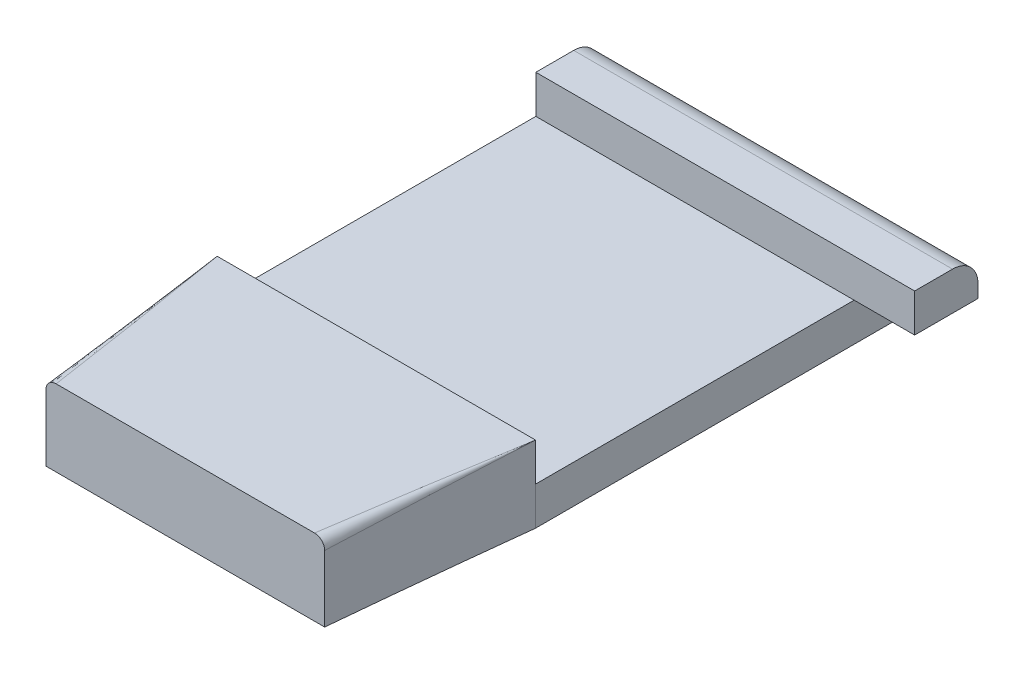
ISO-10303-21;
HEADER;
FILE_DESCRIPTION(('STEP AP214'),'2;1');
FILE_NAME('part.step','',(''),(''),'','','');
FILE_SCHEMA(('AUTOMOTIVE_DESIGN { 1 0 10303 214 1 1 1 1 }'));
ENDSEC;
DATA;
#1=APPLICATION_CONTEXT('core data for automotive mechanical design processes');
#2=APPLICATION_PROTOCOL_DEFINITION('international standard','automotive_design',2000,#1);
#3=PRODUCT_CONTEXT('',#1,'mechanical');
#4=PRODUCT('Part','Part','',(#3));
#5=PRODUCT_RELATED_PRODUCT_CATEGORY('part','',(#4));
#6=PRODUCT_DEFINITION_FORMATION('','',#4);
#7=PRODUCT_DEFINITION_CONTEXT('part definition',#1,'design');
#8=PRODUCT_DEFINITION('design','',#6,#7);
#9=PRODUCT_DEFINITION_SHAPE('','',#8);
#10=(LENGTH_UNIT() NAMED_UNIT(*) SI_UNIT(.MILLI.,.METRE.));
#11=(NAMED_UNIT(*) PLANE_ANGLE_UNIT() SI_UNIT($,.RADIAN.));
#12=(NAMED_UNIT(*) SI_UNIT($,.STERADIAN.) SOLID_ANGLE_UNIT());
#13=UNCERTAINTY_MEASURE_WITH_UNIT(LENGTH_MEASURE(1.E-05),#10,'distance_accuracy_value','');
#14=(GEOMETRIC_REPRESENTATION_CONTEXT(3) GLOBAL_UNCERTAINTY_ASSIGNED_CONTEXT((#13)) GLOBAL_UNIT_ASSIGNED_CONTEXT((#10,
#11,#12)) REPRESENTATION_CONTEXT('',''));
#15=CARTESIAN_POINT('',(0.,0.,0.));
#16=DIRECTION('',(0.,0.,1.));
#17=DIRECTION('',(1.,0.,0.));
#18=AXIS2_PLACEMENT_3D('',#15,#16,#17);
#19=CARTESIAN_POINT('',(0.,3.,0.));
#20=DIRECTION('',(0.,1.,0.));
#21=DIRECTION('',(0.,0.,1.));
#22=AXIS2_PLACEMENT_3D('',#19,#20,#21);
#23=PLANE('',#22);
#24=DIRECTION('',(0.,0.,1.));
#25=VECTOR('',#24,1.);
#26=CARTESIAN_POINT('',(106.597267150879,3.,30.));
#27=LINE('',#26,#25);
#28=CARTESIAN_POINT('',(106.597267150879,3.,4.975));
#29=VERTEX_POINT('',#28);
#30=CARTESIAN_POINT('',(106.597267150879,3.,30.));
#31=VERTEX_POINT('',#30);
#32=EDGE_CURVE('E284',#29,#31,#27,.T.);
#33=ORIENTED_EDGE('',*,*,#32,.F.);
#34=DIRECTION('',(1.,0.,0.));
#35=VECTOR('',#34,1.);
#36=CARTESIAN_POINT('',(81.5972671508789,3.,4.975));
#37=LINE('',#36,#35);
#38=CARTESIAN_POINT('',(81.5972671508789,3.,4.975));
#39=VERTEX_POINT('',#38);
#40=EDGE_CURVE('E266',#39,#29,#37,.T.);
#41=ORIENTED_EDGE('',*,*,#40,.F.);
#42=DIRECTION('',(0.,0.,-1.));
#43=VECTOR('',#42,1.);
#44=CARTESIAN_POINT('',(81.5972671508789,3.,30.));
#45=LINE('',#44,#43);
#46=CARTESIAN_POINT('',(81.5972671508789,3.,30.));
#47=VERTEX_POINT('',#46);
#48=EDGE_CURVE('E287',#47,#39,#45,.T.);
#49=ORIENTED_EDGE('',*,*,#48,.F.);
#50=DIRECTION('',(-1.,0.,0.));
#51=VECTOR('',#50,1.);
#52=CARTESIAN_POINT('',(106.597267150879,3.,30.));
#53=LINE('',#52,#51);
#54=EDGE_CURVE('E283',#31,#47,#53,.T.);
#55=ORIENTED_EDGE('',*,*,#54,.F.);
#56=EDGE_LOOP('',(#33,#41,#49,#55));
#57=FACE_BOUND('',#56,.T.);
#58=ADVANCED_FACE('F46',(#57),#23,.T.);
#59=CARTESIAN_POINT('',(0.,6.,30.));
#60=DIRECTION('',(0.,0.,-1.));
#61=DIRECTION('',(-1.,0.,0.));
#62=AXIS2_PLACEMENT_3D('',#59,#60,#61);
#63=PLANE('',#62);
#64=DIRECTION('',(0.,-1.,0.));
#65=VECTOR('',#64,1.);
#66=CARTESIAN_POINT('',(106.597267150879,6.,30.));
#67=LINE('',#66,#65);
#68=CARTESIAN_POINT('',(106.597267150879,6.,30.));
#69=VERTEX_POINT('',#68);
#70=EDGE_CURVE('E322',#69,#31,#67,.T.);
#71=ORIENTED_EDGE('',*,*,#70,.T.);
#72=ORIENTED_EDGE('',*,*,#54,.T.);
#73=DIRECTION('',(0.,-1.,0.));
#74=VECTOR('',#73,1.);
#75=CARTESIAN_POINT('',(81.5972671508789,6.,30.));
#76=LINE('',#75,#74);
#77=CARTESIAN_POINT('',(81.5972671508789,6.,30.));
#78=VERTEX_POINT('',#77);
#79=EDGE_CURVE('E312',#78,#47,#76,.T.);
#80=ORIENTED_EDGE('',*,*,#79,.F.);
#81=DIRECTION('',(1.,0.,0.));
#82=VECTOR('',#81,1.);
#83=CARTESIAN_POINT('',(0.,6.,30.));
#84=LINE('',#83,#82);
#85=EDGE_CURVE('E307',#78,#69,#84,.T.);
#86=ORIENTED_EDGE('',*,*,#85,.T.);
#87=EDGE_LOOP('',(#71,#72,#80,#86));
#88=FACE_BOUND('',#87,.T.);
#89=ADVANCED_FACE('F365',(#88),#63,.T.);
#90=CARTESIAN_POINT('',(-663.570499194392,6.,115.));
#91=DIRECTION('',(0.,-1.,0.));
#92=DIRECTION('',(0.,0.,-1.));
#93=AXIS2_PLACEMENT_3D('',#90,#91,#92);
#94=CYLINDRICAL_SURFACE('',#93,750.);
#95=CARTESIAN_POINT('',(-663.570499194392,0.,115.));
#96=DIRECTION('',(0.,1.,0.));
#97=DIRECTION('',(0.,0.,1.));
#98=AXIS2_PLACEMENT_3D('',#95,#96,#97);
#99=CIRCLE('',#98,750.);
#100=CARTESIAN_POINT('',(81.5972671508789,0.,30.));
#101=VERTEX_POINT('',#100);
#102=CARTESIAN_POINT('',(83.155688909387,0.,45.));
#103=VERTEX_POINT('',#102);
#104=EDGE_CURVE('E161',#101,#103,#99,.F.);
#105=ORIENTED_EDGE('',*,*,#104,.T.);
#106=DIRECTION('',(0.,-1.,0.));
#107=VECTOR('',#106,1.);
#108=CARTESIAN_POINT('',(83.155688909387,6.,45.));
#109=LINE('',#108,#107);
#110=CARTESIAN_POINT('',(83.1556761300614,5.21164546671452,45.0000001965936));
#111=VERTEX_POINT('',#110);
#112=EDGE_CURVE('E146',#103,#111,#109,.F.);
#113=ORIENTED_EDGE('',*,*,#112,.T.);
#114=CARTESIAN_POINT('',(81.5972671508788,6.,29.9999999999994));
#115=CARTESIAN_POINT('',(83.2062799317841,5.24999994127888,44.1056995290375));
#116=CARTESIAN_POINT('',(84.4146625646699,4.49999999996592,58.2570935038831));
#117=CARTESIAN_POINT('',(85.6233705449503,3.65625000001701,79.5185195161014));
#118=CARTESIAN_POINT('',(85.9256490779134,3.42187499998134,86.6113819054473));
#119=CARTESIAN_POINT('',(86.3287142104268,3.09375000001865,100.802829606762));
#120=CARTESIAN_POINT('',(86.429500805608,3.,107.901414764918));
#121=CARTESIAN_POINT('',(86.4295008056084,3.,122.098585235081));
#122=CARTESIAN_POINT('',(86.3287142104264,3.09375000001866,129.197170393242));
#123=CARTESIAN_POINT('',(85.9256490779138,3.42187499998135,143.388618094551));
#124=CARTESIAN_POINT('',(85.6233705449534,3.65625000001705,150.481480483837));
#125=CARTESIAN_POINT('',(84.4146625646635,4.49999999996596,171.742906496244));
#126=CARTESIAN_POINT('',(83.2062799317906,5.24999994055407,185.894300470906));
#127=CARTESIAN_POINT('',(81.5972671508789,6.,200.));
#128=(BOUNDED_CURVE() B_SPLINE_CURVE(3,(#114,#115,#116,#117,#118,#119,#120,#121,#122,#123,#124,
#125,#126,#127),.UNSPECIFIED.,.F.,.F.) B_SPLINE_CURVE_WITH_KNOTS((4,2,2,2,2,2,4),
(1.45721896303359,1.51400764491425,1.54240198585457,1.5707963267949,1.59919066773522,
1.62758500867555,1.6843736905562),
.UNSPECIFIED.) CURVE() GEOMETRIC_REPRESENTATION_ITEM() RATIONAL_B_SPLINE_CURVE((1.,1.,1.,1.,1.,
1.,1.,1.,1.,1.,1.,1.,1.,1.)) REPRESENTATION_ITEM(''));
#129=EDGE_CURVE('E156',#111,#78,#128,.F.);
#130=ORIENTED_EDGE('',*,*,#129,.T.);
#131=ORIENTED_EDGE('',*,*,#79,.T.);
#132=DIRECTION('',(0.,-1.,0.));
#133=VECTOR('',#132,1.);
#134=CARTESIAN_POINT('',(81.5972671508789,3.,30.));
#135=LINE('',#134,#133);
#136=EDGE_CURVE('E300',#47,#101,#135,.T.);
#137=ORIENTED_EDGE('',*,*,#136,.T.);
#138=EDGE_LOOP('',(#105,#113,#130,#131,#137));
#139=FACE_BOUND('',#138,.T.);
#140=ADVANCED_FACE('F154',(#139),#94,.F.);
#141=CARTESIAN_POINT('',(851.76503349615,6.,115.));
#142=DIRECTION('',(0.,-1.,0.));
#143=DIRECTION('',(0.,0.,-1.));
#144=AXIS2_PLACEMENT_3D('',#141,#142,#143);
#145=CYLINDRICAL_SURFACE('',#144,750.);
#146=CARTESIAN_POINT('',(106.597267150879,6.,199.999999999997));
#147=CARTESIAN_POINT('',(104.98825436999,5.24999993713063,185.894300471102));
#148=CARTESIAN_POINT('',(103.779871737092,4.49999999996471,171.742906496225));
#149=CARTESIAN_POINT('',(102.571163756806,3.65625000001776,150.481480483848));
#150=CARTESIAN_POINT('',(102.268885223843,3.42187499998477,143.388618094539));
#151=CARTESIAN_POINT('',(101.865820091332,3.09375000001516,129.19717039325));
#152=CARTESIAN_POINT('',(101.765033496149,3.00000000000154,122.09858523508));
#153=CARTESIAN_POINT('',(101.76503349615,2.99999999999846,107.901414764917));
#154=CARTESIAN_POINT('',(101.86582009133,3.09375000001831,100.80282960676));
#155=CARTESIAN_POINT('',(102.268885223845,3.42187499998177,86.6113819054441));
#156=CARTESIAN_POINT('',(102.571163756806,3.65625000001452,79.518519516112));
#157=CARTESIAN_POINT('',(103.77987173709,4.4999999999707,58.2570935038658));
#158=CARTESIAN_POINT('',(104.988254369975,5.24999994073761,44.1056995290216));
#159=CARTESIAN_POINT('',(106.597267150879,6.,29.9999999999994));
#160=(BOUNDED_CURVE() B_SPLINE_CURVE(3,(#146,#147,#148,#149,#150,#151,#152,#153,#154,#155,#156,
#157,#158,#159),.UNSPECIFIED.,.F.,.F.) B_SPLINE_CURVE_WITH_KNOTS((4,2,2,2,2,2,4),
(4.59881161662339,4.65560029850404,4.68399463944436,4.71238898038469,4.74078332132502,
4.76917766226534,4.82596634414599),
.UNSPECIFIED.) CURVE() GEOMETRIC_REPRESENTATION_ITEM() RATIONAL_B_SPLINE_CURVE((1.,1.,1.,1.,1.,
1.,1.,1.,1.,1.,1.,1.,1.,1.)) REPRESENTATION_ITEM(''));
#161=CARTESIAN_POINT('',(105.038853887454,5.21165708840962,45.0000003921199));
#162=VERTEX_POINT('',#161);
#163=EDGE_CURVE('E428',#69,#162,#160,.F.);
#164=ORIENTED_EDGE('',*,*,#163,.T.);
#165=DIRECTION('',(0.,-1.,0.));
#166=VECTOR('',#165,1.);
#167=CARTESIAN_POINT('',(105.038845392371,6.,45.));
#168=LINE('',#167,#166);
#169=CARTESIAN_POINT('',(105.038845392371,0.,45.));
#170=VERTEX_POINT('',#169);
#171=EDGE_CURVE('E251',#162,#170,#168,.T.);
#172=ORIENTED_EDGE('',*,*,#171,.T.);
#173=CARTESIAN_POINT('',(851.76503349615,0.,115.));
#174=DIRECTION('',(0.,1.,0.));
#175=DIRECTION('',(0.,0.,1.));
#176=AXIS2_PLACEMENT_3D('',#173,#174,#175);
#177=CIRCLE('',#176,750.);
#178=CARTESIAN_POINT('',(106.597267150879,0.,30.));
#179=VERTEX_POINT('',#178);
#180=EDGE_CURVE('E305',#170,#179,#177,.F.);
#181=ORIENTED_EDGE('',*,*,#180,.T.);
#182=DIRECTION('',(0.,-1.,0.));
#183=VECTOR('',#182,1.);
#184=CARTESIAN_POINT('',(106.597267150879,3.,30.));
#185=LINE('',#184,#183);
#186=EDGE_CURVE('E290',#31,#179,#185,.T.);
#187=ORIENTED_EDGE('',*,*,#186,.F.);
#188=ORIENTED_EDGE('',*,*,#70,.F.);
#189=EDGE_LOOP('',(#164,#172,#181,#187,#188));
#190=FACE_BOUND('',#189,.T.);
#191=ADVANCED_FACE('F335',(#190),#145,.F.);
#192=CARTESIAN_POINT('',(0.,6.,0.));
#193=DIRECTION('',(0.,1.,0.));
#194=DIRECTION('',(0.,0.,1.));
#195=AXIS2_PLACEMENT_3D('',#192,#193,#194);
#196=PLANE('',#195);
#197=DIRECTION('',(-1.,0.,0.));
#198=VECTOR('',#197,1.);
#199=CARTESIAN_POINT('',(0.,6.,45.));
#200=LINE('',#199,#198);
#201=CARTESIAN_POINT('',(104.243337477084,6.,45.0000000007444));
#202=VERTEX_POINT('',#201);
#203=CARTESIAN_POINT('',(83.9512141345285,6.,44.9999999998057));
#204=VERTEX_POINT('',#203);
#205=EDGE_CURVE('E62',#202,#204,#200,.T.);
#206=ORIENTED_EDGE('',*,*,#205,.F.);
#207=CARTESIAN_POINT('',(106.597267150879,6.,29.9999999999994));
#208=CARTESIAN_POINT('',(104.243306710969,6.,44.0193882796078));
#209=CARTESIAN_POINT('',(102.284505766993,6.,58.1329769778131));
#210=CARTESIAN_POINT('',(100.230084002653,6.,79.4049822113751));
#211=CARTESIAN_POINT('',(99.6925362995021,6.,86.5122438411736));
#212=CARTESIAN_POINT('',(98.9600047245418,6.,100.746263381872));
#213=CARTESIAN_POINT('',(98.7650334961006,6.,107.873020423946));
#214=CARTESIAN_POINT('',(98.7650334961991,6.,122.12697957605));
#215=CARTESIAN_POINT('',(98.9600047249849,6.,129.253736618124));
#216=CARTESIAN_POINT('',(99.6925362990585,6.,143.487756158823));
#217=CARTESIAN_POINT('',(100.230084002752,6.,150.595017788628));
#218=CARTESIAN_POINT('',(102.284505766796,6.,171.86702302219));
#219=CARTESIAN_POINT('',(104.243306710582,6.,185.98061172048));
#220=CARTESIAN_POINT('',(106.597267150879,6.,199.999999999997));
#221=(BOUNDED_CURVE() B_SPLINE_CURVE(3,(#207,#208,#209,#210,#211,#212,#213,#214,#215,#216,#217,
#218,#219,#220),.UNSPECIFIED.,.F.,.F.) B_SPLINE_CURVE_WITH_KNOTS((4,2,2,2,2,2,4),
(4.59881161662339,4.65560029850404,4.68399463944436,4.71238898038469,4.74078332132502,
4.76917766226534,4.82596634414599),
.UNSPECIFIED.) CURVE() GEOMETRIC_REPRESENTATION_ITEM() RATIONAL_B_SPLINE_CURVE((0.999999999999973,
0.999999999999973,0.999999999999973,0.999999999999973,0.999999999999973,0.999999999999973,
0.999999999999973,0.999999999999973,0.999999999999973,0.999999999999973,0.999999999999973,
0.999999999999973,0.999999999999973,0.999999999999973)) REPRESENTATION_ITEM(''));
#222=EDGE_CURVE('E317',#202,#69,#221,.F.);
#223=ORIENTED_EDGE('',*,*,#222,.T.);
#224=ORIENTED_EDGE('',*,*,#85,.F.);
#225=CARTESIAN_POINT('',(81.5972671508789,6.,200.));
#226=CARTESIAN_POINT('',(83.9512275914429,6.,185.980611720473));
#227=CARTESIAN_POINT('',(85.9100285345366,6.,171.867023022186));
#228=CARTESIAN_POINT('',(87.9644502992186,6.,150.595017788629));
#229=CARTESIAN_POINT('',(88.5019980023426,6.,143.487756158828));
#230=CARTESIAN_POINT('',(89.2345295771292,6.,129.253736618123));
#231=CARTESIAN_POINT('',(89.429500805608,6.,122.126979576007));
#232=CARTESIAN_POINT('',(89.429500805608,6.,107.873020423992));
#233=CARTESIAN_POINT('',(89.2345295771785,6.,100.746263381828));
#234=CARTESIAN_POINT('',(88.5019980022934,6.,86.5122438412223));
#235=CARTESIAN_POINT('',(87.9644502989724,6.,79.4049822114219));
#236=CARTESIAN_POINT('',(85.9100285350292,6.,58.1329769777163));
#237=CARTESIAN_POINT('',(83.9512275903507,6.,44.0193882797219));
#238=CARTESIAN_POINT('',(81.5972671508788,6.,29.9999999999994));
#239=(BOUNDED_CURVE() B_SPLINE_CURVE(3,(#225,#226,#227,#228,#229,#230,#231,#232,#233,#234,#235,
#236,#237,#238),.UNSPECIFIED.,.F.,.F.) B_SPLINE_CURVE_WITH_KNOTS((4,2,2,2,2,2,4),
(1.45721896303359,1.51400764491425,1.54240198585457,1.5707963267949,1.59919066773522,
1.62758500867555,1.6843736905562),
.UNSPECIFIED.) CURVE() GEOMETRIC_REPRESENTATION_ITEM() RATIONAL_B_SPLINE_CURVE((0.99999999999997,
0.99999999999997,0.99999999999997,0.99999999999997,0.99999999999997,0.99999999999997,
0.99999999999997,0.99999999999997,0.99999999999997,0.99999999999997,0.99999999999997,
0.99999999999997,0.99999999999997,0.99999999999997)) REPRESENTATION_ITEM(''));
#240=EDGE_CURVE('E166',#78,#204,#239,.F.);
#241=ORIENTED_EDGE('',*,*,#240,.T.);
#242=EDGE_LOOP('',(#206,#223,#224,#241));
#243=FACE_BOUND('',#242,.T.);
#244=ADVANCED_FACE('F324',(#243),#196,.T.);
#245=CARTESIAN_POINT('',(0.,0.,0.));
#246=DIRECTION('',(0.,1.,0.));
#247=DIRECTION('',(0.,0.,1.));
#248=AXIS2_PLACEMENT_3D('',#245,#246,#247);
#249=PLANE('',#248);
#250=ORIENTED_EDGE('',*,*,#180,.F.);
#251=DIRECTION('',(-1.,0.,0.));
#252=VECTOR('',#251,1.);
#253=CARTESIAN_POINT('',(0.,0.,45.));
#254=LINE('',#253,#252);
#255=EDGE_CURVE('E249',#170,#103,#254,.T.);
#256=ORIENTED_EDGE('',*,*,#255,.T.);
#257=ORIENTED_EDGE('',*,*,#104,.F.);
#258=DIRECTION('',(0.,0.,-1.));
#259=VECTOR('',#258,1.);
#260=CARTESIAN_POINT('',(81.5972671508789,0.,30.));
#261=LINE('',#260,#259);
#262=CARTESIAN_POINT('',(81.5972671508789,0.,0.5));
#263=VERTEX_POINT('',#262);
#264=EDGE_CURVE('E293',#101,#263,#261,.T.);
#265=ORIENTED_EDGE('',*,*,#264,.T.);
#266=DIRECTION('',(1.,0.,0.));
#267=VECTOR('',#266,1.);
#268=CARTESIAN_POINT('',(106.597267150879,0.,0.5));
#269=LINE('',#268,#267);
#270=CARTESIAN_POINT('',(106.597267150879,0.,0.5));
#271=VERTEX_POINT('',#270);
#272=EDGE_CURVE('E168',#263,#271,#269,.T.);
#273=ORIENTED_EDGE('',*,*,#272,.T.);
#274=DIRECTION('',(0.,0.,1.));
#275=VECTOR('',#274,1.);
#276=CARTESIAN_POINT('',(106.597267150879,0.,30.));
#277=LINE('',#276,#275);
#278=EDGE_CURVE('E279',#271,#179,#277,.T.);
#279=ORIENTED_EDGE('',*,*,#278,.T.);
#280=EDGE_LOOP('',(#250,#256,#257,#265,#273,#279));
#281=FACE_BOUND('',#280,.T.);
#282=ADVANCED_FACE('F334',(#281),#249,.F.);
#283=CARTESIAN_POINT('',(106.597267150879,3.,30.));
#284=DIRECTION('',(1.,0.,0.));
#285=DIRECTION('',(0.,0.,-1.));
#286=AXIS2_PLACEMENT_3D('',#283,#284,#285);
#287=PLANE('',#286);
#288=ORIENTED_EDGE('',*,*,#278,.F.);
#289=CARTESIAN_POINT('',(106.597267150879,0.5,0.5));
#290=DIRECTION('',(1.,0.,0.));
#291=DIRECTION('',(0.,0.,-1.));
#292=AXIS2_PLACEMENT_3D('',#289,#290,#291);
#293=CIRCLE('',#292,0.5);
#294=CARTESIAN_POINT('',(106.597267150879,0.5,0.));
#295=VERTEX_POINT('',#294);
#296=EDGE_CURVE('E406',#271,#295,#293,.T.);
#297=ORIENTED_EDGE('',*,*,#296,.T.);
#298=DIRECTION('',(0.,-1.,0.));
#299=VECTOR('',#298,1.);
#300=CARTESIAN_POINT('',(106.597267150879,3.,0.));
#301=LINE('',#300,#299);
#302=CARTESIAN_POINT('',(106.597267150879,3.,0.));
#303=VERTEX_POINT('',#302);
#304=EDGE_CURVE('E296',#303,#295,#301,.T.);
#305=ORIENTED_EDGE('',*,*,#304,.F.);
#306=EDGE_CURVE('E280',#303,#29,#27,.T.);
#307=ORIENTED_EDGE('',*,*,#306,.T.);
#308=ORIENTED_EDGE('',*,*,#32,.T.);
#309=ORIENTED_EDGE('',*,*,#186,.T.);
#310=EDGE_LOOP('',(#288,#297,#305,#307,#308,#309));
#311=FACE_BOUND('',#310,.T.);
#312=ADVANCED_FACE('F337',(#311),#287,.T.);
#313=CARTESIAN_POINT('',(106.597267150879,3.,0.));
#314=DIRECTION('',(0.,0.,-1.));
#315=DIRECTION('',(-1.,0.,0.));
#316=AXIS2_PLACEMENT_3D('',#313,#314,#315);
#317=PLANE('',#316);
#318=ORIENTED_EDGE('',*,*,#304,.T.);
#319=DIRECTION('',(1.,0.,0.));
#320=VECTOR('',#319,1.);
#321=CARTESIAN_POINT('',(81.5972671508789,0.5,0.));
#322=LINE('',#321,#320);
#323=CARTESIAN_POINT('',(81.5972671508789,0.5,0.));
#324=VERTEX_POINT('',#323);
#325=EDGE_CURVE('E70',#295,#324,#322,.F.);
#326=ORIENTED_EDGE('',*,*,#325,.T.);
#327=DIRECTION('',(0.,-1.,0.));
#328=VECTOR('',#327,1.);
#329=CARTESIAN_POINT('',(81.5972671508789,3.,0.));
#330=LINE('',#329,#328);
#331=CARTESIAN_POINT('',(81.5972671508789,4.,0.));
#332=VERTEX_POINT('',#331);
#333=EDGE_CURVE('E298',#332,#324,#330,.T.);
#334=ORIENTED_EDGE('',*,*,#333,.F.);
#335=DIRECTION('',(-1.,0.,0.));
#336=VECTOR('',#335,1.);
#337=CARTESIAN_POINT('',(106.597267150879,4.,0.));
#338=LINE('',#337,#336);
#339=CARTESIAN_POINT('',(111.347267150879,4.,0.));
#340=VERTEX_POINT('',#339);
#341=EDGE_CURVE('E314',#332,#340,#338,.F.);
#342=ORIENTED_EDGE('',*,*,#341,.T.);
#343=DIRECTION('',(0.,-1.,0.));
#344=VECTOR('',#343,1.);
#345=CARTESIAN_POINT('',(111.347267150879,6.,0.));
#346=LINE('',#345,#344);
#347=CARTESIAN_POINT('',(111.347267150879,3.,0.));
#348=VERTEX_POINT('',#347);
#349=EDGE_CURVE('E265',#340,#348,#346,.T.);
#350=ORIENTED_EDGE('',*,*,#349,.T.);
#351=DIRECTION('',(-1.,0.,0.));
#352=VECTOR('',#351,1.);
#353=CARTESIAN_POINT('',(81.5972671508789,3.,0.));
#354=LINE('',#353,#352);
#355=EDGE_CURVE('E260',#348,#303,#354,.T.);
#356=ORIENTED_EDGE('',*,*,#355,.T.);
#357=EDGE_LOOP('',(#318,#326,#334,#342,#350,#356));
#358=FACE_BOUND('',#357,.T.);
#359=ADVANCED_FACE('F390',(#358),#317,.T.);
#360=CARTESIAN_POINT('',(81.5972671508789,3.,30.));
#361=DIRECTION('',(-1.,0.,0.));
#362=DIRECTION('',(0.,0.,1.));
#363=AXIS2_PLACEMENT_3D('',#360,#361,#362);
#364=PLANE('',#363);
#365=ORIENTED_EDGE('',*,*,#333,.T.);
#366=CARTESIAN_POINT('',(81.5972671508789,0.5,0.5));
#367=DIRECTION('',(-1.,0.,0.));
#368=DIRECTION('',(0.,0.,1.));
#369=AXIS2_PLACEMENT_3D('',#366,#367,#368);
#370=CIRCLE('',#369,0.5);
#371=EDGE_CURVE('E55',#324,#263,#370,.T.);
#372=ORIENTED_EDGE('',*,*,#371,.T.);
#373=ORIENTED_EDGE('',*,*,#264,.F.);
#374=ORIENTED_EDGE('',*,*,#136,.F.);
#375=ORIENTED_EDGE('',*,*,#48,.T.);
#376=DIRECTION('',(0.,-1.,0.));
#377=VECTOR('',#376,1.);
#378=CARTESIAN_POINT('',(81.5972671508789,6.,4.975));
#379=LINE('',#378,#377);
#380=CARTESIAN_POINT('',(81.5972671508789,6.,4.975));
#381=VERTEX_POINT('',#380);
#382=EDGE_CURVE('E277',#381,#39,#379,.T.);
#383=ORIENTED_EDGE('',*,*,#382,.F.);
#384=DIRECTION('',(0.,0.,1.));
#385=VECTOR('',#384,1.);
#386=CARTESIAN_POINT('',(81.5972671508789,6.,0.));
#387=LINE('',#386,#385);
#388=CARTESIAN_POINT('',(81.5972671508789,6.,2.));
#389=VERTEX_POINT('',#388);
#390=EDGE_CURVE('E257',#389,#381,#387,.T.);
#391=ORIENTED_EDGE('',*,*,#390,.F.);
#392=CARTESIAN_POINT('',(81.5972671508789,4.,2.));
#393=DIRECTION('',(-1.,0.,0.));
#394=DIRECTION('',(0.,0.,1.));
#395=AXIS2_PLACEMENT_3D('',#392,#393,#394);
#396=CIRCLE('',#395,2.);
#397=EDGE_CURVE('E311',#389,#332,#396,.T.);
#398=ORIENTED_EDGE('',*,*,#397,.T.);
#399=EDGE_LOOP('',(#365,#372,#373,#374,#375,#383,#391,#398));
#400=FACE_BOUND('',#399,.T.);
#401=ADVANCED_FACE('F392',(#400),#364,.T.);
#402=CARTESIAN_POINT('',(81.5972671508789,6.,4.975));
#403=DIRECTION('',(0.,0.,-1.));
#404=DIRECTION('',(-1.,0.,0.));
#405=AXIS2_PLACEMENT_3D('',#402,#403,#404);
#406=PLANE('',#405);
#407=ORIENTED_EDGE('',*,*,#40,.T.);
#408=CARTESIAN_POINT('',(111.347267150879,3.,4.975));
#409=VERTEX_POINT('',#408);
#410=EDGE_CURVE('E254',#29,#409,#37,.T.);
#411=ORIENTED_EDGE('',*,*,#410,.T.);
#412=DIRECTION('',(0.,-1.,0.));
#413=VECTOR('',#412,1.);
#414=CARTESIAN_POINT('',(111.347267150879,6.,4.975));
#415=LINE('',#414,#413);
#416=CARTESIAN_POINT('',(111.347267150879,6.,4.975));
#417=VERTEX_POINT('',#416);
#418=EDGE_CURVE('E274',#417,#409,#415,.T.);
#419=ORIENTED_EDGE('',*,*,#418,.F.);
#420=DIRECTION('',(1.,0.,0.));
#421=VECTOR('',#420,1.);
#422=CARTESIAN_POINT('',(81.5972671508789,6.,4.975));
#423=LINE('',#422,#421);
#424=EDGE_CURVE('E259',#381,#417,#423,.T.);
#425=ORIENTED_EDGE('',*,*,#424,.F.);
#426=ORIENTED_EDGE('',*,*,#382,.T.);
#427=EDGE_LOOP('',(#407,#411,#419,#425,#426));
#428=FACE_BOUND('',#427,.T.);
#429=ADVANCED_FACE('F388',(#428),#406,.F.);
#430=CARTESIAN_POINT('',(111.347267150879,6.,0.));
#431=DIRECTION('',(-1.,0.,0.));
#432=DIRECTION('',(0.,0.,1.));
#433=AXIS2_PLACEMENT_3D('',#430,#431,#432);
#434=PLANE('',#433);
#435=ORIENTED_EDGE('',*,*,#349,.F.);
#436=CARTESIAN_POINT('',(111.347267150879,4.,2.));
#437=DIRECTION('',(-1.,0.,0.));
#438=DIRECTION('',(0.,0.,1.));
#439=AXIS2_PLACEMENT_3D('',#436,#437,#438);
#440=CIRCLE('',#439,2.);
#441=CARTESIAN_POINT('',(111.347267150879,6.,2.));
#442=VERTEX_POINT('',#441);
#443=EDGE_CURVE('E316',#340,#442,#440,.F.);
#444=ORIENTED_EDGE('',*,*,#443,.T.);
#445=DIRECTION('',(0.,0.,-1.));
#446=VECTOR('',#445,1.);
#447=CARTESIAN_POINT('',(111.347267150879,6.,0.));
#448=LINE('',#447,#446);
#449=EDGE_CURVE('E262',#417,#442,#448,.T.);
#450=ORIENTED_EDGE('',*,*,#449,.F.);
#451=ORIENTED_EDGE('',*,*,#418,.T.);
#452=DIRECTION('',(0.,0.,-1.));
#453=VECTOR('',#452,1.);
#454=CARTESIAN_POINT('',(111.347267150879,3.,0.));
#455=LINE('',#454,#453);
#456=EDGE_CURVE('E269',#409,#348,#455,.T.);
#457=ORIENTED_EDGE('',*,*,#456,.T.);
#458=EDGE_LOOP('',(#435,#444,#450,#451,#457));
#459=FACE_BOUND('',#458,.T.);
#460=ADVANCED_FACE('F398',(#459),#434,.F.);
#461=CARTESIAN_POINT('',(0.,6.,0.));
#462=DIRECTION('',(0.,1.,0.));
#463=DIRECTION('',(0.,0.,1.));
#464=AXIS2_PLACEMENT_3D('',#461,#462,#463);
#465=PLANE('',#464);
#466=ORIENTED_EDGE('',*,*,#449,.T.);
#467=DIRECTION('',(-1.,0.,0.));
#468=VECTOR('',#467,1.);
#469=CARTESIAN_POINT('',(0.,6.,2.));
#470=LINE('',#469,#468);
#471=EDGE_CURVE('E308',#442,#389,#470,.T.);
#472=ORIENTED_EDGE('',*,*,#471,.T.);
#473=ORIENTED_EDGE('',*,*,#390,.T.);
#474=ORIENTED_EDGE('',*,*,#424,.T.);
#475=EDGE_LOOP('',(#466,#472,#473,#474));
#476=FACE_BOUND('',#475,.T.);
#477=ADVANCED_FACE('F237',(#476),#465,.T.);
#478=CARTESIAN_POINT('',(0.,3.,0.));
#479=DIRECTION('',(0.,1.,0.));
#480=DIRECTION('',(0.,0.,1.));
#481=AXIS2_PLACEMENT_3D('',#478,#479,#480);
#482=PLANE('',#481);
#483=ORIENTED_EDGE('',*,*,#306,.F.);
#484=ORIENTED_EDGE('',*,*,#355,.F.);
#485=ORIENTED_EDGE('',*,*,#456,.F.);
#486=ORIENTED_EDGE('',*,*,#410,.F.);
#487=EDGE_LOOP('',(#483,#484,#485,#486));
#488=FACE_BOUND('',#487,.T.);
#489=ADVANCED_FACE('F371',(#488),#482,.F.);
#490=CARTESIAN_POINT('',(0.,4.,2.));
#491=DIRECTION('',(-1.,0.,0.));
#492=DIRECTION('',(0.,0.,1.));
#493=AXIS2_PLACEMENT_3D('',#490,#491,#492);
#494=CYLINDRICAL_SURFACE('',#493,2.);
#495=ORIENTED_EDGE('',*,*,#443,.F.);
#496=ORIENTED_EDGE('',*,*,#341,.F.);
#497=ORIENTED_EDGE('',*,*,#397,.F.);
#498=ORIENTED_EDGE('',*,*,#471,.F.);
#499=EDGE_LOOP('',(#495,#496,#497,#498));
#500=FACE_BOUND('',#499,.T.);
#501=ADVANCED_FACE('F369',(#500),#494,.T.);
#502=CARTESIAN_POINT('',(106.597267150879,6.,29.9999999999994));
#503=CARTESIAN_POINT('',(104.988254369975,5.24999994073761,44.1056995290216));
#504=CARTESIAN_POINT('',(103.77987173709,4.4999999999707,58.2570935038658));
#505=CARTESIAN_POINT('',(102.571163756806,3.65625000001452,79.518519516112));
#506=CARTESIAN_POINT('',(102.268885223845,3.42187499998177,86.6113819054441));
#507=CARTESIAN_POINT('',(101.86582009133,3.09375000001831,100.80282960676));
#508=CARTESIAN_POINT('',(101.76503349615,2.99999999999846,107.901414764917));
#509=CARTESIAN_POINT('',(101.765033496149,3.00000000000154,122.09858523508));
#510=CARTESIAN_POINT('',(101.865820091332,3.09375000001516,129.19717039325));
#511=CARTESIAN_POINT('',(102.268885223843,3.42187499998477,143.388618094539));
#512=CARTESIAN_POINT('',(102.571163756806,3.65625000001776,150.481480483848));
#513=CARTESIAN_POINT('',(103.779871737092,4.49999999996471,171.742906496225));
#514=CARTESIAN_POINT('',(104.98825436999,5.24999993713063,185.894300471102));
#515=CARTESIAN_POINT('',(106.597267150879,6.,199.999999999997));
#516=CARTESIAN_POINT('',(106.597267150879,6.,29.9999999999994));
#517=CARTESIAN_POINT('',(104.988254368572,5.99999999990764,44.1056995319905));
#518=CARTESIAN_POINT('',(103.779871736552,6.00000000009851,58.2570935038352));
#519=CARTESIAN_POINT('',(102.571163757075,5.99999999995074,79.5185195161273));
#520=CARTESIAN_POINT('',(102.26888522397,6.,86.6113819054477));
#521=CARTESIAN_POINT('',(101.865820091205,6.,100.802829606757));
#522=CARTESIAN_POINT('',(101.7650334961,6.,107.901414764868));
#523=CARTESIAN_POINT('',(101.765033496199,6.,122.098585235129));
#524=CARTESIAN_POINT('',(101.865820091697,5.99999999995074,129.19717039324));
#525=CARTESIAN_POINT('',(102.268885223478,6.00000000004926,143.388618094549));
#526=CARTESIAN_POINT('',(102.571163757174,6.00000000004926,150.481480483827));
#527=CARTESIAN_POINT('',(103.779871736356,5.99999999990149,171.742906496267));
#528=CARTESIAN_POINT('',(104.988254371274,6.00000000009851,185.894300467643));
#529=CARTESIAN_POINT('',(106.597267150879,6.,199.999999999997));
#530=CARTESIAN_POINT('',(106.597267150879,6.,29.9999999999994));
#531=CARTESIAN_POINT('',(104.243306710969,6.,44.0193882796078));
#532=CARTESIAN_POINT('',(102.284505766993,6.,58.1329769778131));
#533=CARTESIAN_POINT('',(100.230084002653,6.,79.4049822113751));
#534=CARTESIAN_POINT('',(99.6925362995019,6.,86.5122438411736));
#535=CARTESIAN_POINT('',(98.9600047245416,6.,100.746263381872));
#536=CARTESIAN_POINT('',(98.7650334961004,6.,107.873020423946));
#537=CARTESIAN_POINT('',(98.7650334961989,6.,122.12697957605));
#538=CARTESIAN_POINT('',(98.9600047249847,6.,129.253736618124));
#539=CARTESIAN_POINT('',(99.6925362990583,6.,143.487756158823));
#540=CARTESIAN_POINT('',(100.230084002752,6.,150.595017788628));
#541=CARTESIAN_POINT('',(102.284505766796,6.,171.86702302219));
#542=CARTESIAN_POINT('',(104.243306710582,6.,185.98061172048));
#543=CARTESIAN_POINT('',(106.597267150879,6.,199.999999999997));
#544=(BOUNDED_SURFACE() B_SPLINE_SURFACE(2,3,((#502,#503,#504,#505,#506,#507,#508,#509,#510,
#511,#512,#513,#514,#515),(#516,#517,#518,#519,#520,#521,#522,#523,#524,#525,#526,#527,#528,
#529),(#530,#531,#532,#533,#534,#535,#536,#537,#538,#539,#540,#541,#542,#543)),.UNSPECIFIED.,
.F.,.F.,.F.) B_SPLINE_SURFACE_WITH_KNOTS((3,3),(4,2,2,2,2,2,4),(0.,1.),(4.59881161662339,
4.65560029850404,4.68399463944436,4.71238898038469,4.74078332132502,4.76917766226534,
4.82596634414599),.UNSPECIFIED.) GEOMETRIC_REPRESENTATION_ITEM() RATIONAL_B_SPLINE_SURFACE(((1.,
1.,1.,1.,1.,1.,1.,1.,1.,1.,1.,1.,1.,1.),(0.707106781186548,0.70710678118655,0.707106781186548,
0.707106781186548,0.707106781186547,0.707106781186547,0.707106781186547,0.707106781186547,
0.707106781186547,0.707106781186547,0.707106781186548,0.707106781186548,0.707106781186547,
0.707106781186548),(1.,1.,1.,1.,1.,1.,1.,1.,1.,1.,1.,1.,1.,1.))) REPRESENTATION_ITEM('') SURFACE());
#545=CARTESIAN_POINT('',(105.038862455739,5.21163382353432,45.0000000016276));
#546=CARTESIAN_POINT('',(105.038902311491,5.255745686639,45.0000000005845));
#547=CARTESIAN_POINT('',(105.035146571757,5.29984706318797,45.0000000001566));
#548=CARTESIAN_POINT('',(105.020319708499,5.38676266287701,44.9999999998435));
#549=CARTESIAN_POINT('',(105.009255261602,5.42957802352858,44.9999999999578));
#550=CARTESIAN_POINT('',(104.980080366297,5.51275607564475,45.0000000000417));
#551=CARTESIAN_POINT('',(104.961967257308,5.55311783431659,45.0000000000112));
#552=CARTESIAN_POINT('',(104.919237413694,5.63022730149946,44.9999999999888));
#553=CARTESIAN_POINT('',(104.894621687359,5.66697556910473,44.9999999999968));
#554=CARTESIAN_POINT('',(104.83955078425,5.73589970330173,45.0000000000028));
#555=CARTESIAN_POINT('',(104.809085863795,5.7680677821925,45.0000000000008));
#556=CARTESIAN_POINT('',(104.74322156016,5.82687883081963,44.9999999999992));
#557=CARTESIAN_POINT('',(104.707821901841,5.85352149227718,44.9999999999998));
#558=CARTESIAN_POINT('',(104.63281476114,5.9007476732354,45.0000000000001));
#559=CARTESIAN_POINT('',(104.593177254402,5.92128344653814,44.9999999999999));
#560=CARTESIAN_POINT('',(104.511046266489,5.95547547816086,45.0000000000001));
#561=CARTESIAN_POINT('',(104.468553984916,5.9691346058669,45.0000000000004));
#562=CARTESIAN_POINT('',(104.395424131849,5.98610537937621,45.0000000000003));
#563=CARTESIAN_POINT('',(104.365212374146,5.99131431401727,45.0000000000001));
#564=CARTESIAN_POINT('',(104.304437403126,5.9982613257106,44.9999999999999));
#565=CARTESIAN_POINT('',(104.273874771942,6.00000449529664,44.9999999999999));
#566=CARTESIAN_POINT('',(104.243300160692,6.,45.0000000000003));
#567=B_SPLINE_CURVE_WITH_KNOTS('',3,(#545,#546,#547,#548,#549,#550,#551,#552,#553,#554,#555,
#556,#557,#558,#559,#560,#561,#562,#563,#564,#565,#566),.UNSPECIFIED.,.F.,.F.,(4,2,2,2,2,2,2,2,
2,2,4),(0.,0.132160593393677,0.264200622521935,0.396290539730097,0.528359987176525,
0.660651377357495,0.792950146468563,0.926257616336146,1.0595094154147,1.15129493614474,
1.24294548888753),.UNSPECIFIED.);
#568=EDGE_CURVE('E162',#162,#202,#567,.T.);
#569=ORIENTED_EDGE('',*,*,#568,.F.);
#570=ORIENTED_EDGE('',*,*,#163,.F.);
#571=ORIENTED_EDGE('',*,*,#222,.F.);
#572=EDGE_LOOP('',(#569,#570,#571));
#573=FACE_BOUND('',#572,.T.);
#574=ADVANCED_FACE('F193',(#573),#544,.T.);
#575=CARTESIAN_POINT('',(81.5972671508789,6.,200.));
#576=CARTESIAN_POINT('',(83.2062799317906,5.24999994055407,185.894300470906));
#577=CARTESIAN_POINT('',(84.4146625646635,4.49999999996596,171.742906496244));
#578=CARTESIAN_POINT('',(85.6233705449534,3.65625000001705,150.481480483837));
#579=CARTESIAN_POINT('',(85.9256490779138,3.42187499998135,143.388618094551));
#580=CARTESIAN_POINT('',(86.3287142104264,3.09375000001866,129.197170393242));
#581=CARTESIAN_POINT('',(86.4295008056084,3.,122.098585235081));
#582=CARTESIAN_POINT('',(86.429500805608,3.,107.901414764918));
#583=CARTESIAN_POINT('',(86.3287142104268,3.09375000001865,100.802829606762));
#584=CARTESIAN_POINT('',(85.9256490779134,3.42187499998134,86.6113819054473));
#585=CARTESIAN_POINT('',(85.6233705449503,3.65625000001701,79.5185195161014));
#586=CARTESIAN_POINT('',(84.4146625646699,4.49999999996592,58.2570935038831));
#587=CARTESIAN_POINT('',(83.2062799317841,5.24999994127888,44.1056995290375));
#588=CARTESIAN_POINT('',(81.5972671508788,6.,29.9999999999994));
#589=CARTESIAN_POINT('',(81.5972671508789,6.,200.));
#590=CARTESIAN_POINT('',(83.2062799339284,6.,185.894300468001));
#591=CARTESIAN_POINT('',(84.4146625649726,6.,171.742906496262));
#592=CARTESIAN_POINT('',(85.6233705447989,6.,150.481480483828));
#593=CARTESIAN_POINT('',(85.9256490779016,6.00000000004927,143.38861809455));
#594=CARTESIAN_POINT('',(86.3287142104386,5.99999999995076,129.197170393242));
#595=CARTESIAN_POINT('',(86.4295008056082,6.,122.098585235081));
#596=CARTESIAN_POINT('',(86.4295008056082,6.,107.901414764918));
#597=CARTESIAN_POINT('',(86.3287142105372,6.,100.802829606709));
#598=CARTESIAN_POINT('',(85.9256490778031,6.,86.6113819054997));
#599=CARTESIAN_POINT('',(85.6233705445527,6.,79.518519516124));
#600=CARTESIAN_POINT('',(84.4146625654652,6.,58.2570935038378));
#601=CARTESIAN_POINT('',(83.2062799333121,6.,44.1056995319526));
#602=CARTESIAN_POINT('',(81.5972671508788,6.,29.9999999999994));
#603=CARTESIAN_POINT('',(81.5972671508789,6.,200.));
#604=CARTESIAN_POINT('',(83.9512275914429,6.,185.980611720473));
#605=CARTESIAN_POINT('',(85.9100285345367,6.,171.867023022186));
#606=CARTESIAN_POINT('',(87.9644502992188,6.,150.595017788629));
#607=CARTESIAN_POINT('',(88.5019980023427,6.,143.487756158828));
#608=CARTESIAN_POINT('',(89.2345295771294,6.,129.253736618123));
#609=CARTESIAN_POINT('',(89.4295008056082,6.,122.126979576007));
#610=CARTESIAN_POINT('',(89.4295008056082,6.,107.873020423992));
#611=CARTESIAN_POINT('',(89.2345295771787,6.,100.746263381828));
#612=CARTESIAN_POINT('',(88.5019980022935,6.,86.5122438412223));
#613=CARTESIAN_POINT('',(87.9644502989726,6.,79.4049822114218));
#614=CARTESIAN_POINT('',(85.9100285350293,6.,58.1329769777162));
#615=CARTESIAN_POINT('',(83.9512275903507,6.,44.0193882797219));
#616=CARTESIAN_POINT('',(81.5972671508788,6.,29.9999999999994));
#617=(BOUNDED_SURFACE() B_SPLINE_SURFACE(2,3,((#575,#576,#577,#578,#579,#580,#581,#582,#583,
#584,#585,#586,#587,#588),(#589,#590,#591,#592,#593,#594,#595,#596,#597,#598,#599,#600,#601,
#602),(#603,#604,#605,#606,#607,#608,#609,#610,#611,#612,#613,#614,#615,#616)),.UNSPECIFIED.,
.F.,.F.,.F.) B_SPLINE_SURFACE_WITH_KNOTS((3,3),(4,2,2,2,2,2,4),(0.,1.),(1.45721896303359,
1.51400764491425,1.54240198585457,1.5707963267949,1.59919066773522,1.62758500867555,
1.6843736905562),.UNSPECIFIED.) GEOMETRIC_REPRESENTATION_ITEM() RATIONAL_B_SPLINE_SURFACE(((1.,
1.,1.,1.,1.,1.,1.,1.,1.,1.,1.,1.,1.,1.),(0.707106781186548,0.707106781186547,0.707106781186548,
0.707106781186548,0.707106781186546,0.707106781186546,0.707106781186547,0.707106781186547,
0.707106781186548,0.707106781186548,0.707106781186548,0.707106781186548,0.707106781186548,
0.707106781186548),(1.,1.,1.,1.,1.,1.,1.,1.,1.,1.,1.,1.,1.,1.))) REPRESENTATION_ITEM('') SURFACE());
#618=CARTESIAN_POINT('',(83.9512341409323,6.,44.9999999988065));
#619=CARTESIAN_POINT('',(83.9059686102458,6.00003735317027,44.9999999995715));
#620=CARTESIAN_POINT('',(83.8607088185133,5.99619201501083,44.9999999998852));
#621=CARTESIAN_POINT('',(83.7714869259581,5.98098672158412,45.0000000001147));
#622=CARTESIAN_POINT('',(83.7275243264123,5.96962969467049,45.0000000000307));
#623=CARTESIAN_POINT('',(83.6421620066158,5.93965712771212,44.9999999999692));
#624=CARTESIAN_POINT('',(83.6007613187074,5.92104434786375,44.9999999999918));
#625=CARTESIAN_POINT('',(83.5217240566686,5.8770778593413,45.0000000000082));
#626=CARTESIAN_POINT('',(83.484086285505,5.85172630380978,45.0000000000022));
#627=CARTESIAN_POINT('',(83.4139949969558,5.79523649398588,44.9999999999979));
#628=CARTESIAN_POINT('',(83.3814979841226,5.76415221534389,44.9999999999994));
#629=CARTESIAN_POINT('',(83.3222487827963,5.69692178419511,45.0000000000006));
#630=CARTESIAN_POINT('',(83.2954960249285,5.66077613396242,45.0000000000002));
#631=CARTESIAN_POINT('',(83.2487557075423,5.58482224968077,44.9999999999999));
#632=CARTESIAN_POINT('',(83.2287068809454,5.54505166416062,45.));
#633=CARTESIAN_POINT('',(83.1956295423014,5.46270397274133,45.));
#634=CARTESIAN_POINT('',(83.1825962126134,5.4201288153891,45.0000000000001));
#635=CARTESIAN_POINT('',(83.1674082325352,5.34965110537848,45.));
#636=CARTESIAN_POINT('',(83.1630082852642,5.32221201240629,45.));
#637=CARTESIAN_POINT('',(83.1571408315618,5.2670637871622,45.));
#638=CARTESIAN_POINT('',(83.1556689293624,5.2393551225331,45.));
#639=CARTESIAN_POINT('',(83.155671845714,5.21163382384909,45.0000000000001));
#640=B_SPLINE_CURVE_WITH_KNOTS('',3,(#618,#619,#620,#621,#622,#623,#624,#625,#626,#627,#628,
#629,#630,#631,#632,#633,#634,#635,#636,#637,#638,#639),.UNSPECIFIED.,.F.,.F.,(4,2,2,2,2,2,2,2,
2,2,4),(0.,0.135625944273604,0.271199047323828,0.406720626598413,0.542198956583471,
0.676461413152874,0.810710555381345,0.94369693913387,1.07659188236833,1.15981686117651,
1.24291680276056),.UNSPECIFIED.);
#641=EDGE_CURVE('E12',#204,#111,#640,.T.);
#642=ORIENTED_EDGE('',*,*,#641,.F.);
#643=ORIENTED_EDGE('',*,*,#240,.F.);
#644=ORIENTED_EDGE('',*,*,#129,.F.);
#645=EDGE_LOOP('',(#642,#643,#644));
#646=FACE_BOUND('',#645,.T.);
#647=ADVANCED_FACE('F165',(#646),#617,.T.);
#648=CARTESIAN_POINT('',(0.,0.5,0.5));
#649=DIRECTION('',(-1.,0.,0.));
#650=DIRECTION('',(0.,0.,1.));
#651=AXIS2_PLACEMENT_3D('',#648,#649,#650);
#652=CYLINDRICAL_SURFACE('',#651,0.5);
#653=ORIENTED_EDGE('',*,*,#371,.F.);
#654=ORIENTED_EDGE('',*,*,#325,.F.);
#655=ORIENTED_EDGE('',*,*,#296,.F.);
#656=ORIENTED_EDGE('',*,*,#272,.F.);
#657=EDGE_LOOP('',(#653,#654,#655,#656));
#658=FACE_BOUND('',#657,.T.);
#659=ADVANCED_FACE('F48',(#658),#652,.T.);
#660=CARTESIAN_POINT('',(0.,0.,45.));
#661=DIRECTION('',(0.,0.,-1.));
#662=DIRECTION('',(-1.,0.,0.));
#663=AXIS2_PLACEMENT_3D('',#660,#661,#662);
#664=PLANE('',#663);
#665=ORIENTED_EDGE('',*,*,#568,.T.);
#666=ORIENTED_EDGE('',*,*,#205,.T.);
#667=ORIENTED_EDGE('',*,*,#641,.T.);
#668=ORIENTED_EDGE('',*,*,#112,.F.);
#669=ORIENTED_EDGE('',*,*,#255,.F.);
#670=ORIENTED_EDGE('',*,*,#171,.F.);
#671=EDGE_LOOP('',(#665,#666,#667,#668,#669,#670));
#672=FACE_BOUND('',#671,.T.);
#673=ADVANCED_FACE('F145',(#672),#664,.F.);
#674=CLOSED_SHELL('',(#58,#89,#140,#191,#244,#282,#312,#359,#401,#429,#460,#477,#489,#501,#574,
#647,#659,#673));
#675=MANIFOLD_SOLID_BREP('B2',#674);
#676=ADVANCED_BREP_SHAPE_REPRESENTATION('',(#18,#675),#14);
#677=SHAPE_DEFINITION_REPRESENTATION(#9,#676);
ENDSEC;
END-ISO-10303-21;
